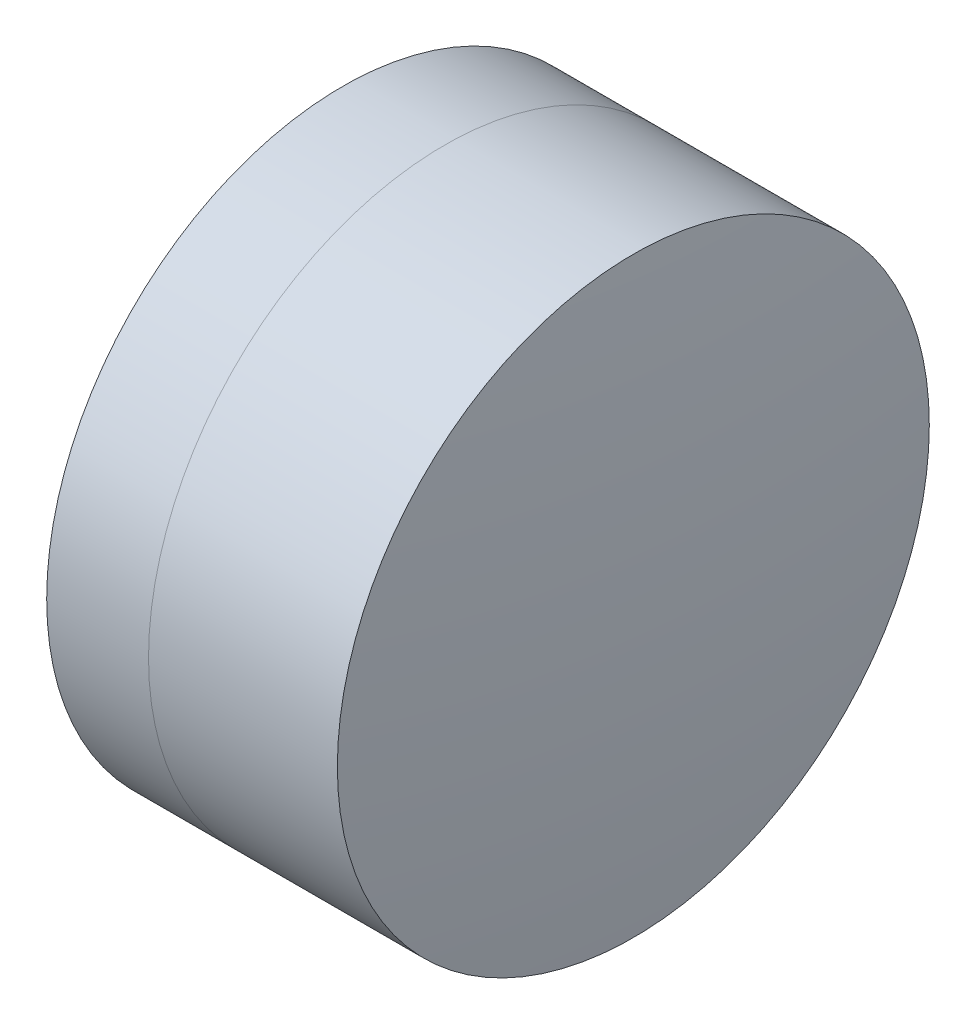
ISO-10303-21;
HEADER;
FILE_DESCRIPTION(('STEP AP214'),'2;1');
FILE_NAME('part.step','',(''),(''),'','','');
FILE_SCHEMA(('AUTOMOTIVE_DESIGN { 1 0 10303 214 1 1 1 1 }'));
ENDSEC;
DATA;
#1=APPLICATION_CONTEXT('core data for automotive mechanical design processes');
#2=APPLICATION_PROTOCOL_DEFINITION('international standard','automotive_design',2000,#1);
#3=PRODUCT_CONTEXT('',#1,'mechanical');
#4=PRODUCT('Part','Part','',(#3));
#5=PRODUCT_RELATED_PRODUCT_CATEGORY('part','',(#4));
#6=PRODUCT_DEFINITION_FORMATION('','',#4);
#7=PRODUCT_DEFINITION_CONTEXT('part definition',#1,'design');
#8=PRODUCT_DEFINITION('design','',#6,#7);
#9=PRODUCT_DEFINITION_SHAPE('','',#8);
#10=(LENGTH_UNIT() NAMED_UNIT(*) SI_UNIT(.MILLI.,.METRE.));
#11=(NAMED_UNIT(*) PLANE_ANGLE_UNIT() SI_UNIT($,.RADIAN.));
#12=(NAMED_UNIT(*) SI_UNIT($,.STERADIAN.) SOLID_ANGLE_UNIT());
#13=UNCERTAINTY_MEASURE_WITH_UNIT(LENGTH_MEASURE(1.E-05),#10,'distance_accuracy_value','');
#14=(GEOMETRIC_REPRESENTATION_CONTEXT(3) GLOBAL_UNCERTAINTY_ASSIGNED_CONTEXT((#13)) GLOBAL_UNIT_ASSIGNED_CONTEXT((#10,
#11,#12)) REPRESENTATION_CONTEXT('',''));
#15=CARTESIAN_POINT('',(0.,0.,0.));
#16=DIRECTION('',(0.,0.,1.));
#17=DIRECTION('',(1.,0.,0.));
#18=AXIS2_PLACEMENT_3D('',#15,#16,#17);
#19=CARTESIAN_POINT('',(255.780712754671,0.,0.));
#20=DIRECTION('',(-1.,0.,0.));
#21=DIRECTION('',(0.,0.,1.));
#22=AXIS2_PLACEMENT_3D('',#19,#20,#21);
#23=SPHERICAL_SURFACE('',#22,6.70000000000028);
#24=CARTESIAN_POINT('',(261.680659788332,0.,0.));
#25=DIRECTION('',(-1.,0.,0.));
#26=DIRECTION('',(0.,0.,1.));
#27=AXIS2_PLACEMENT_3D('',#24,#25,#26);
#28=CIRCLE('',#27,3.175);
#29=CARTESIAN_POINT('',(261.680659788332,0.,3.175));
#30=VERTEX_POINT('',#29);
#31=EDGE_CURVE('E11',#30,#30,#28,.T.);
#32=ORIENTED_EDGE('',*,*,#31,.T.);
#33=EDGE_LOOP('',(#32));
#34=FACE_BOUND('',#33,.T.);
#35=ADVANCED_FACE('F49',(#34),#23,.F.);
#36=CARTESIAN_POINT('',(-0.551919992657797,0.,0.));
#37=DIRECTION('',(-1.,0.,0.));
#38=DIRECTION('',(0.,0.,1.));
#39=AXIS2_PLACEMENT_3D('',#36,#37,#38);
#40=CYLINDRICAL_SURFACE('',#39,3.175);
#41=CARTESIAN_POINT('',(263.706384906418,0.,0.));
#42=DIRECTION('',(-1.,0.,0.));
#43=DIRECTION('',(0.,0.,1.));
#44=AXIS2_PLACEMENT_3D('',#41,#42,#43);
#45=CIRCLE('',#44,3.175);
#46=CARTESIAN_POINT('',(263.706384906418,0.,3.175));
#47=VERTEX_POINT('',#46);
#48=EDGE_CURVE('E56',#47,#47,#45,.T.);
#49=ORIENTED_EDGE('',*,*,#48,.T.);
#50=EDGE_LOOP('',(#49));
#51=FACE_BOUND('',#50,.T.);
#52=ORIENTED_EDGE('',*,*,#31,.F.);
#53=EDGE_LOOP('',(#52));
#54=FACE_BOUND('',#53,.T.);
#55=ADVANCED_FACE('F63',(#51,#54),#40,.T.);
#56=CARTESIAN_POINT('',(234.880712754671,0.,0.));
#57=DIRECTION('',(-1.,0.,0.));
#58=DIRECTION('',(0.,0.,1.));
#59=AXIS2_PLACEMENT_3D('',#56,#57,#58);
#60=SPHERICAL_SURFACE('',#59,29.);
#61=ORIENTED_EDGE('',*,*,#48,.F.);
#62=EDGE_LOOP('',(#61));
#63=FACE_BOUND('',#62,.T.);
#64=ADVANCED_FACE('F66',(#63),#60,.T.);
#65=CLOSED_SHELL('',(#35,#55,#64));
#66=MANIFOLD_SOLID_BREP('B2',#65);
#67=CARTESIAN_POINT('',(268.580712754671,0.,0.));
#68=DIRECTION('',(-1.,0.,0.));
#69=DIRECTION('',(0.,0.,-1.));
#70=AXIS2_PLACEMENT_3D('',#67,#68,#69);
#71=SPHERICAL_SURFACE('',#70,8.6);
#72=CARTESIAN_POINT('',(260.588255372864,0.,0.));
#73=DIRECTION('',(-1.,0.,0.));
#74=DIRECTION('',(0.,0.,1.));
#75=AXIS2_PLACEMENT_3D('',#72,#73,#74);
#76=CIRCLE('',#75,3.175);
#77=CARTESIAN_POINT('',(260.588255372864,0.,3.175));
#78=VERTEX_POINT('',#77);
#79=EDGE_CURVE('E48',#78,#78,#76,.T.);
#80=ORIENTED_EDGE('',*,*,#79,.T.);
#81=EDGE_LOOP('',(#80));
#82=FACE_BOUND('',#81,.T.);
#83=ADVANCED_FACE('F95',(#82),#71,.T.);
#84=CARTESIAN_POINT('',(124.523309526045,0.,0.));
#85=DIRECTION('',(-1.,0.,0.));
#86=DIRECTION('',(0.,0.,1.));
#87=AXIS2_PLACEMENT_3D('',#84,#85,#86);
#88=CYLINDRICAL_SURFACE('',#87,3.175);
#89=CARTESIAN_POINT('',(261.680659788332,0.,0.));
#90=DIRECTION('',(-1.,0.,0.));
#91=DIRECTION('',(0.,0.,1.));
#92=AXIS2_PLACEMENT_3D('',#89,#90,#91);
#93=CIRCLE('',#92,3.175);
#94=CARTESIAN_POINT('',(261.680659788332,0.,3.175));
#95=VERTEX_POINT('',#94);
#96=EDGE_CURVE('E102',#95,#95,#93,.T.);
#97=ORIENTED_EDGE('',*,*,#96,.T.);
#98=EDGE_LOOP('',(#97));
#99=FACE_BOUND('',#98,.T.);
#100=ORIENTED_EDGE('',*,*,#79,.F.);
#101=EDGE_LOOP('',(#100));
#102=FACE_BOUND('',#101,.T.);
#103=ADVANCED_FACE('F109',(#99,#102),#88,.T.);
#104=CARTESIAN_POINT('',(255.780712754671,0.,0.));
#105=DIRECTION('',(-1.,0.,0.));
#106=DIRECTION('',(0.,0.,1.));
#107=AXIS2_PLACEMENT_3D('',#104,#105,#106);
#108=SPHERICAL_SURFACE('',#107,6.70000000000027);
#109=ORIENTED_EDGE('',*,*,#96,.F.);
#110=EDGE_LOOP('',(#109));
#111=FACE_BOUND('',#110,.T.);
#112=ADVANCED_FACE('F112',(#111),#108,.T.);
#113=CLOSED_SHELL('',(#83,#103,#112));
#114=MANIFOLD_SOLID_BREP('B6',#113);
#115=ADVANCED_BREP_SHAPE_REPRESENTATION('',(#18,#66,#114),#14);
#116=SHAPE_DEFINITION_REPRESENTATION(#9,#115);
ENDSEC;
END-ISO-10303-21;
